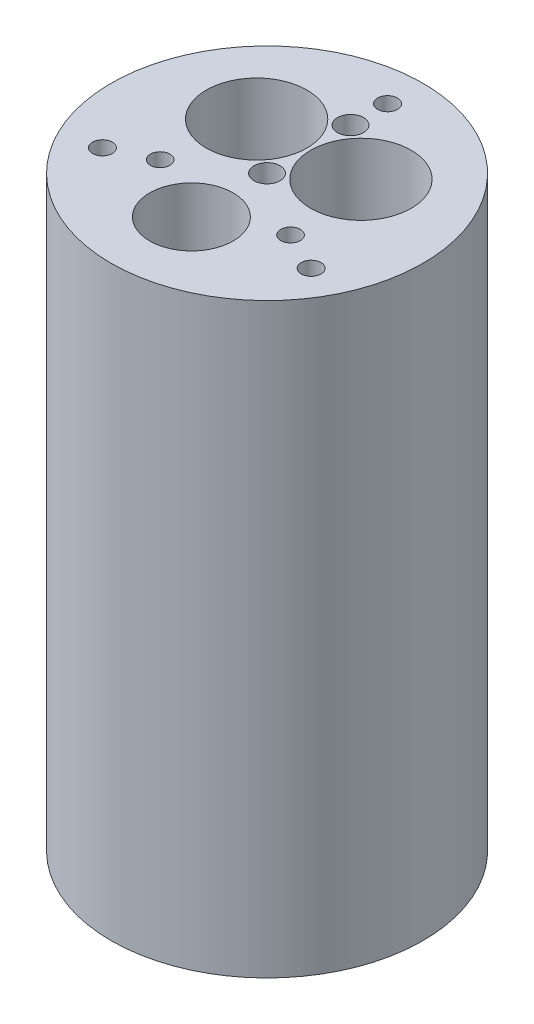
ISO-10303-21;
HEADER;
FILE_DESCRIPTION(('STEP AP214'),'2;1');
FILE_NAME('part.step','',(''),(''),'','','');
FILE_SCHEMA(('AUTOMOTIVE_DESIGN { 1 0 10303 214 1 1 1 1 }'));
ENDSEC;
DATA;
#1=APPLICATION_CONTEXT('core data for automotive mechanical design processes');
#2=APPLICATION_PROTOCOL_DEFINITION('international standard','automotive_design',2000,#1);
#3=PRODUCT_CONTEXT('',#1,'mechanical');
#4=PRODUCT('Part','Part','',(#3));
#5=PRODUCT_RELATED_PRODUCT_CATEGORY('part','',(#4));
#6=PRODUCT_DEFINITION_FORMATION('','',#4);
#7=PRODUCT_DEFINITION_CONTEXT('part definition',#1,'design');
#8=PRODUCT_DEFINITION('design','',#6,#7);
#9=PRODUCT_DEFINITION_SHAPE('','',#8);
#10=(LENGTH_UNIT() NAMED_UNIT(*) SI_UNIT(.MILLI.,.METRE.));
#11=(NAMED_UNIT(*) PLANE_ANGLE_UNIT() SI_UNIT($,.RADIAN.));
#12=(NAMED_UNIT(*) SI_UNIT($,.STERADIAN.) SOLID_ANGLE_UNIT());
#13=UNCERTAINTY_MEASURE_WITH_UNIT(LENGTH_MEASURE(1.E-05),#10,'distance_accuracy_value','');
#14=(GEOMETRIC_REPRESENTATION_CONTEXT(3) GLOBAL_UNCERTAINTY_ASSIGNED_CONTEXT((#13)) GLOBAL_UNIT_ASSIGNED_CONTEXT((#10,
#11,#12)) REPRESENTATION_CONTEXT('',''));
#15=CARTESIAN_POINT('',(0.,0.,0.));
#16=DIRECTION('',(0.,0.,1.));
#17=DIRECTION('',(1.,0.,0.));
#18=AXIS2_PLACEMENT_3D('',#15,#16,#17);
#19=CARTESIAN_POINT('',(0.,142.8496,0.));
#20=DIRECTION('',(0.,-1.,0.));
#21=DIRECTION('',(0.,0.,-1.));
#22=AXIS2_PLACEMENT_3D('',#19,#20,#21);
#23=CYLINDRICAL_SURFACE('',#22,37.973);
#24=CARTESIAN_POINT('',(0.,142.8496,0.));
#25=DIRECTION('',(0.,1.,0.));
#26=DIRECTION('',(0.,0.,1.));
#27=AXIS2_PLACEMENT_3D('',#24,#25,#26);
#28=CIRCLE('',#27,37.973);
#29=CARTESIAN_POINT('',(0.,142.8496,37.973));
#30=VERTEX_POINT('',#29);
#31=EDGE_CURVE('E10',#30,#30,#28,.T.);
#32=ORIENTED_EDGE('',*,*,#31,.F.);
#33=EDGE_LOOP('',(#32));
#34=FACE_BOUND('',#33,.T.);
#35=CARTESIAN_POINT('',(0.,0.,0.));
#36=DIRECTION('',(0.,1.,0.));
#37=DIRECTION('',(0.,0.,1.));
#38=AXIS2_PLACEMENT_3D('',#35,#36,#37);
#39=CIRCLE('',#38,37.973);
#40=CARTESIAN_POINT('',(0.,0.,37.973));
#41=VERTEX_POINT('',#40);
#42=EDGE_CURVE('E38',#41,#41,#39,.T.);
#43=ORIENTED_EDGE('',*,*,#42,.T.);
#44=EDGE_LOOP('',(#43));
#45=FACE_BOUND('',#44,.T.);
#46=ADVANCED_FACE('F35',(#34,#45),#23,.T.);
#47=CARTESIAN_POINT('',(0.,142.8496,0.));
#48=DIRECTION('',(0.,1.,0.));
#49=DIRECTION('',(0.,0.,1.));
#50=AXIS2_PLACEMENT_3D('',#47,#48,#49);
#51=PLANE('',#50);
#52=CARTESIAN_POINT('',(15.875,142.8496,10.16));
#53=DIRECTION('',(0.,1.,0.));
#54=DIRECTION('',(0.,0.,1.));
#55=AXIS2_PLACEMENT_3D('',#52,#53,#54);
#56=CIRCLE('',#55,2.38125000000001);
#57=CARTESIAN_POINT('',(15.875,142.8496,12.54125));
#58=VERTEX_POINT('',#57);
#59=EDGE_CURVE('E92',#58,#58,#56,.T.);
#60=ORIENTED_EDGE('',*,*,#59,.F.);
#61=EDGE_LOOP('',(#60));
#62=FACE_BOUND('',#61,.T.);
#63=CARTESIAN_POINT('',(-15.875,142.8496,10.16));
#64=DIRECTION('',(0.,1.,0.));
#65=DIRECTION('',(0.,0.,1.));
#66=AXIS2_PLACEMENT_3D('',#63,#64,#65);
#67=CIRCLE('',#66,2.38125);
#68=CARTESIAN_POINT('',(-15.875,142.8496,12.54125));
#69=VERTEX_POINT('',#68);
#70=EDGE_CURVE('E97',#69,#69,#67,.T.);
#71=ORIENTED_EDGE('',*,*,#70,.F.);
#72=EDGE_LOOP('',(#71));
#73=FACE_BOUND('',#72,.T.);
#74=CARTESIAN_POINT('',(0.,142.8496,18.415));
#75=DIRECTION('',(0.,1.,0.));
#76=DIRECTION('',(0.,0.,1.));
#77=AXIS2_PLACEMENT_3D('',#74,#75,#76);
#78=CIRCLE('',#77,10.16);
#79=CARTESIAN_POINT('',(0.,142.8496,28.575));
#80=VERTEX_POINT('',#79);
#81=EDGE_CURVE('E89',#80,#80,#78,.T.);
#82=ORIENTED_EDGE('',*,*,#81,.F.);
#83=EDGE_LOOP('',(#82));
#84=FACE_BOUND('',#83,.T.);
#85=CARTESIAN_POINT('',(0.,142.8496,-20.32));
#86=DIRECTION('',(0.,1.,0.));
#87=DIRECTION('',(0.,0.,1.));
#88=AXIS2_PLACEMENT_3D('',#85,#86,#87);
#89=CIRCLE('',#88,3.175);
#90=CARTESIAN_POINT('',(0.,142.8496,-17.145));
#91=VERTEX_POINT('',#90);
#92=EDGE_CURVE('E84',#91,#91,#89,.T.);
#93=ORIENTED_EDGE('',*,*,#92,.F.);
#94=EDGE_LOOP('',(#93));
#95=FACE_BOUND('',#94,.T.);
#96=CARTESIAN_POINT('',(0.,142.8496,0.));
#97=DIRECTION('',(0.,1.,0.));
#98=DIRECTION('',(0.,0.,1.));
#99=AXIS2_PLACEMENT_3D('',#96,#97,#98);
#100=CIRCLE('',#99,3.175);
#101=CARTESIAN_POINT('',(0.,142.8496,3.175));
#102=VERTEX_POINT('',#101);
#103=EDGE_CURVE('E77',#102,#102,#100,.T.);
#104=ORIENTED_EDGE('',*,*,#103,.F.);
#105=EDGE_LOOP('',(#104));
#106=FACE_BOUND('',#105,.T.);
#107=CARTESIAN_POINT('',(-12.7,142.8496,-10.16));
#108=DIRECTION('',(0.,1.,0.));
#109=DIRECTION('',(0.,0.,1.));
#110=AXIS2_PLACEMENT_3D('',#107,#108,#109);
#111=CIRCLE('',#110,12.2555);
#112=CARTESIAN_POINT('',(-12.7,142.8496,2.0955));
#113=VERTEX_POINT('',#112);
#114=EDGE_CURVE('E72',#113,#113,#111,.T.);
#115=ORIENTED_EDGE('',*,*,#114,.F.);
#116=EDGE_LOOP('',(#115));
#117=FACE_BOUND('',#116,.T.);
#118=CARTESIAN_POINT('',(12.7,142.8496,-10.16));
#119=DIRECTION('',(0.,1.,0.));
#120=DIRECTION('',(0.,0.,1.));
#121=AXIS2_PLACEMENT_3D('',#118,#119,#120);
#122=CIRCLE('',#121,12.2555);
#123=CARTESIAN_POINT('',(12.7,142.8496,2.0955));
#124=VERTEX_POINT('',#123);
#125=EDGE_CURVE('E65',#124,#124,#122,.T.);
#126=ORIENTED_EDGE('',*,*,#125,.F.);
#127=EDGE_LOOP('',(#126));
#128=FACE_BOUND('',#127,.T.);
#129=CARTESIAN_POINT('',(0.,142.8496,-29.337));
#130=DIRECTION('',(0.,1.,0.));
#131=DIRECTION('',(0.,0.,1.));
#132=AXIS2_PLACEMENT_3D('',#129,#130,#131);
#133=CIRCLE('',#132,2.413);
#134=CARTESIAN_POINT('',(0.,142.8496,-26.924));
#135=VERTEX_POINT('',#134);
#136=EDGE_CURVE('E60',#135,#135,#133,.T.);
#137=ORIENTED_EDGE('',*,*,#136,.F.);
#138=EDGE_LOOP('',(#137));
#139=FACE_BOUND('',#138,.T.);
#140=CARTESIAN_POINT('',(25.4065872708259,142.8496,14.6684999999989));
#141=DIRECTION('',(0.,1.,0.));
#142=DIRECTION('',(0.,0.,1.));
#143=AXIS2_PLACEMENT_3D('',#140,#141,#142);
#144=CIRCLE('',#143,2.413);
#145=CARTESIAN_POINT('',(25.4065872708259,142.8496,17.0814999999989));
#146=VERTEX_POINT('',#145);
#147=EDGE_CURVE('E54',#146,#146,#144,.T.);
#148=ORIENTED_EDGE('',*,*,#147,.F.);
#149=EDGE_LOOP('',(#148));
#150=FACE_BOUND('',#149,.T.);
#151=CARTESIAN_POINT('',(-25.4065872708222,142.8496,14.6685000000011));
#152=DIRECTION('',(0.,1.,0.));
#153=DIRECTION('',(0.,0.,1.));
#154=AXIS2_PLACEMENT_3D('',#151,#152,#153);
#155=CIRCLE('',#154,2.413);
#156=CARTESIAN_POINT('',(-25.4065872708222,142.8496,17.0815000000011));
#157=VERTEX_POINT('',#156);
#158=EDGE_CURVE('E47',#157,#157,#155,.T.);
#159=ORIENTED_EDGE('',*,*,#158,.F.);
#160=EDGE_LOOP('',(#159));
#161=FACE_BOUND('',#160,.T.);
#162=ORIENTED_EDGE('',*,*,#31,.T.);
#163=EDGE_LOOP('',(#162));
#164=FACE_BOUND('',#163,.T.);
#165=ADVANCED_FACE('F122',(#62,#73,#84,#95,#106,#117,#128,#139,#150,#161,#164),#51,.T.);
#166=CARTESIAN_POINT('',(0.,0.,0.));
#167=DIRECTION('',(0.,1.,0.));
#168=DIRECTION('',(0.,0.,1.));
#169=AXIS2_PLACEMENT_3D('',#166,#167,#168);
#170=PLANE('',#169);
#171=CARTESIAN_POINT('',(15.875,0.,10.16));
#172=DIRECTION('',(0.,1.,0.));
#173=DIRECTION('',(0.,0.,1.));
#174=AXIS2_PLACEMENT_3D('',#171,#172,#173);
#175=CIRCLE('',#174,2.38125000000001);
#176=CARTESIAN_POINT('',(15.875,0.,12.54125));
#177=VERTEX_POINT('',#176);
#178=EDGE_CURVE('E100',#177,#177,#175,.T.);
#179=ORIENTED_EDGE('',*,*,#178,.T.);
#180=EDGE_LOOP('',(#179));
#181=FACE_BOUND('',#180,.T.);
#182=CARTESIAN_POINT('',(-15.875,0.,10.16));
#183=DIRECTION('',(0.,1.,0.));
#184=DIRECTION('',(0.,0.,1.));
#185=AXIS2_PLACEMENT_3D('',#182,#183,#184);
#186=CIRCLE('',#185,2.38125);
#187=CARTESIAN_POINT('',(-15.875,0.,12.54125));
#188=VERTEX_POINT('',#187);
#189=EDGE_CURVE('E101',#188,#188,#186,.T.);
#190=ORIENTED_EDGE('',*,*,#189,.T.);
#191=EDGE_LOOP('',(#190));
#192=FACE_BOUND('',#191,.T.);
#193=CARTESIAN_POINT('',(-12.7,0.,-10.16));
#194=DIRECTION('',(0.,1.,0.));
#195=DIRECTION('',(0.,0.,1.));
#196=AXIS2_PLACEMENT_3D('',#193,#194,#195);
#197=CIRCLE('',#196,12.2555);
#198=CARTESIAN_POINT('',(-12.7,0.,2.0955));
#199=VERTEX_POINT('',#198);
#200=EDGE_CURVE('E51',#199,#199,#197,.T.);
#201=ORIENTED_EDGE('',*,*,#200,.T.);
#202=EDGE_LOOP('',(#201));
#203=FACE_BOUND('',#202,.T.);
#204=CARTESIAN_POINT('',(12.7,0.,-10.16));
#205=DIRECTION('',(0.,1.,0.));
#206=DIRECTION('',(0.,0.,1.));
#207=AXIS2_PLACEMENT_3D('',#204,#205,#206);
#208=CIRCLE('',#207,12.2555);
#209=CARTESIAN_POINT('',(12.7,0.,2.0955));
#210=VERTEX_POINT('',#209);
#211=EDGE_CURVE('E68',#210,#210,#208,.T.);
#212=ORIENTED_EDGE('',*,*,#211,.T.);
#213=EDGE_LOOP('',(#212));
#214=FACE_BOUND('',#213,.T.);
#215=CARTESIAN_POINT('',(0.,0.,-29.337));
#216=DIRECTION('',(0.,1.,0.));
#217=DIRECTION('',(0.,0.,1.));
#218=AXIS2_PLACEMENT_3D('',#215,#216,#217);
#219=CIRCLE('',#218,2.413);
#220=CARTESIAN_POINT('',(0.,0.,-26.924));
#221=VERTEX_POINT('',#220);
#222=EDGE_CURVE('E45',#221,#221,#219,.T.);
#223=ORIENTED_EDGE('',*,*,#222,.T.);
#224=EDGE_LOOP('',(#223));
#225=FACE_BOUND('',#224,.T.);
#226=CARTESIAN_POINT('',(25.4065872708259,0.,14.6684999999989));
#227=DIRECTION('',(0.,1.,0.));
#228=DIRECTION('',(0.,0.,1.));
#229=AXIS2_PLACEMENT_3D('',#226,#227,#228);
#230=CIRCLE('',#229,2.413);
#231=CARTESIAN_POINT('',(25.4065872708259,0.,17.0814999999989));
#232=VERTEX_POINT('',#231);
#233=EDGE_CURVE('E57',#232,#232,#230,.T.);
#234=ORIENTED_EDGE('',*,*,#233,.T.);
#235=EDGE_LOOP('',(#234));
#236=FACE_BOUND('',#235,.T.);
#237=CARTESIAN_POINT('',(-25.4065872708222,0.,14.6685000000011));
#238=DIRECTION('',(0.,1.,0.));
#239=DIRECTION('',(0.,0.,1.));
#240=AXIS2_PLACEMENT_3D('',#237,#238,#239);
#241=CIRCLE('',#240,2.413);
#242=CARTESIAN_POINT('',(-25.4065872708222,0.,17.0815000000011));
#243=VERTEX_POINT('',#242);
#244=EDGE_CURVE('E50',#243,#243,#241,.T.);
#245=ORIENTED_EDGE('',*,*,#244,.T.);
#246=EDGE_LOOP('',(#245));
#247=FACE_BOUND('',#246,.T.);
#248=ORIENTED_EDGE('',*,*,#42,.F.);
#249=EDGE_LOOP('',(#248));
#250=FACE_BOUND('',#249,.T.);
#251=ADVANCED_FACE('F107',(#181,#192,#203,#214,#225,#236,#247,#250),#170,.F.);
#252=CARTESIAN_POINT('',(-25.4065872708222,0.,14.6685000000011));
#253=DIRECTION('',(0.,1.,0.));
#254=DIRECTION('',(0.,0.,1.));
#255=AXIS2_PLACEMENT_3D('',#252,#253,#254);
#256=CYLINDRICAL_SURFACE('',#255,2.413);
#257=ORIENTED_EDGE('',*,*,#244,.F.);
#258=EDGE_LOOP('',(#257));
#259=FACE_BOUND('',#258,.T.);
#260=ORIENTED_EDGE('',*,*,#158,.T.);
#261=EDGE_LOOP('',(#260));
#262=FACE_BOUND('',#261,.T.);
#263=ADVANCED_FACE('F133',(#259,#262),#256,.F.);
#264=CARTESIAN_POINT('',(25.4065872708259,0.,14.6684999999989));
#265=DIRECTION('',(0.,1.,0.));
#266=DIRECTION('',(0.,0.,1.));
#267=AXIS2_PLACEMENT_3D('',#264,#265,#266);
#268=CYLINDRICAL_SURFACE('',#267,2.413);
#269=ORIENTED_EDGE('',*,*,#233,.F.);
#270=EDGE_LOOP('',(#269));
#271=FACE_BOUND('',#270,.T.);
#272=ORIENTED_EDGE('',*,*,#147,.T.);
#273=EDGE_LOOP('',(#272));
#274=FACE_BOUND('',#273,.T.);
#275=ADVANCED_FACE('F137',(#271,#274),#268,.F.);
#276=CARTESIAN_POINT('',(0.,0.,-29.337));
#277=DIRECTION('',(0.,1.,0.));
#278=DIRECTION('',(0.,0.,1.));
#279=AXIS2_PLACEMENT_3D('',#276,#277,#278);
#280=CYLINDRICAL_SURFACE('',#279,2.413);
#281=ORIENTED_EDGE('',*,*,#222,.F.);
#282=EDGE_LOOP('',(#281));
#283=FACE_BOUND('',#282,.T.);
#284=ORIENTED_EDGE('',*,*,#136,.T.);
#285=EDGE_LOOP('',(#284));
#286=FACE_BOUND('',#285,.T.);
#287=ADVANCED_FACE('F143',(#283,#286),#280,.F.);
#288=CARTESIAN_POINT('',(12.7,0.,-10.16));
#289=DIRECTION('',(0.,1.,0.));
#290=DIRECTION('',(0.,0.,1.));
#291=AXIS2_PLACEMENT_3D('',#288,#289,#290);
#292=CYLINDRICAL_SURFACE('',#291,12.2555);
#293=ORIENTED_EDGE('',*,*,#211,.F.);
#294=EDGE_LOOP('',(#293));
#295=FACE_BOUND('',#294,.T.);
#296=ORIENTED_EDGE('',*,*,#125,.T.);
#297=EDGE_LOOP('',(#296));
#298=FACE_BOUND('',#297,.T.);
#299=ADVANCED_FACE('F147',(#295,#298),#292,.F.);
#300=CARTESIAN_POINT('',(-12.7,0.,-10.16));
#301=DIRECTION('',(0.,1.,0.));
#302=DIRECTION('',(0.,0.,1.));
#303=AXIS2_PLACEMENT_3D('',#300,#301,#302);
#304=CYLINDRICAL_SURFACE('',#303,12.2555);
#305=ORIENTED_EDGE('',*,*,#200,.F.);
#306=EDGE_LOOP('',(#305));
#307=FACE_BOUND('',#306,.T.);
#308=ORIENTED_EDGE('',*,*,#114,.T.);
#309=EDGE_LOOP('',(#308));
#310=FACE_BOUND('',#309,.T.);
#311=ADVANCED_FACE('F151',(#307,#310),#304,.F.);
#312=CARTESIAN_POINT('',(0.,136.4996,0.));
#313=DIRECTION('',(0.,1.,0.));
#314=DIRECTION('',(0.,0.,1.));
#315=AXIS2_PLACEMENT_3D('',#312,#313,#314);
#316=CYLINDRICAL_SURFACE('',#315,3.175);
#317=CARTESIAN_POINT('',(0.,136.4996,0.));
#318=DIRECTION('',(0.,1.,0.));
#319=DIRECTION('',(0.,0.,1.));
#320=AXIS2_PLACEMENT_3D('',#317,#318,#319);
#321=CIRCLE('',#320,3.175);
#322=CARTESIAN_POINT('',(0.,136.4996,3.175));
#323=VERTEX_POINT('',#322);
#324=EDGE_CURVE('E80',#323,#323,#321,.T.);
#325=ORIENTED_EDGE('',*,*,#324,.F.);
#326=EDGE_LOOP('',(#325));
#327=FACE_BOUND('',#326,.T.);
#328=ORIENTED_EDGE('',*,*,#103,.T.);
#329=EDGE_LOOP('',(#328));
#330=FACE_BOUND('',#329,.T.);
#331=ADVANCED_FACE('F155',(#327,#330),#316,.F.);
#332=CARTESIAN_POINT('',(0.,136.4996,0.));
#333=DIRECTION('',(0.,1.,0.));
#334=DIRECTION('',(0.,0.,1.));
#335=AXIS2_PLACEMENT_3D('',#332,#333,#334);
#336=PLANE('',#335);
#337=ORIENTED_EDGE('',*,*,#324,.T.);
#338=EDGE_LOOP('',(#337));
#339=FACE_BOUND('',#338,.T.);
#340=ADVANCED_FACE('F159',(#339),#336,.T.);
#341=CARTESIAN_POINT('',(0.,136.4996,-20.32));
#342=DIRECTION('',(0.,1.,0.));
#343=DIRECTION('',(0.,0.,1.));
#344=AXIS2_PLACEMENT_3D('',#341,#342,#343);
#345=CYLINDRICAL_SURFACE('',#344,3.175);
#346=CARTESIAN_POINT('',(0.,136.4996,-20.32));
#347=DIRECTION('',(0.,1.,0.));
#348=DIRECTION('',(0.,0.,1.));
#349=AXIS2_PLACEMENT_3D('',#346,#347,#348);
#350=CIRCLE('',#349,3.175);
#351=CARTESIAN_POINT('',(0.,136.4996,-17.145));
#352=VERTEX_POINT('',#351);
#353=EDGE_CURVE('E69',#352,#352,#350,.T.);
#354=ORIENTED_EDGE('',*,*,#353,.F.);
#355=EDGE_LOOP('',(#354));
#356=FACE_BOUND('',#355,.T.);
#357=ORIENTED_EDGE('',*,*,#92,.T.);
#358=EDGE_LOOP('',(#357));
#359=FACE_BOUND('',#358,.T.);
#360=ADVANCED_FACE('F163',(#356,#359),#345,.F.);
#361=CARTESIAN_POINT('',(0.,136.4996,-20.32));
#362=DIRECTION('',(0.,1.,0.));
#363=DIRECTION('',(0.,0.,1.));
#364=AXIS2_PLACEMENT_3D('',#361,#362,#363);
#365=PLANE('',#364);
#366=ORIENTED_EDGE('',*,*,#353,.T.);
#367=EDGE_LOOP('',(#366));
#368=FACE_BOUND('',#367,.T.);
#369=ADVANCED_FACE('F167',(#368),#365,.T.);
#370=CARTESIAN_POINT('',(0.,125.0696,18.415));
#371=DIRECTION('',(0.,1.,0.));
#372=DIRECTION('',(0.,0.,1.));
#373=AXIS2_PLACEMENT_3D('',#370,#371,#372);
#374=CYLINDRICAL_SURFACE('',#373,10.16);
#375=CARTESIAN_POINT('',(0.,125.0696,18.415));
#376=DIRECTION('',(0.,1.,0.));
#377=DIRECTION('',(0.,0.,1.));
#378=AXIS2_PLACEMENT_3D('',#375,#376,#377);
#379=CIRCLE('',#378,10.16);
#380=CARTESIAN_POINT('',(0.,125.0696,28.575));
#381=VERTEX_POINT('',#380);
#382=EDGE_CURVE('E81',#381,#381,#379,.T.);
#383=ORIENTED_EDGE('',*,*,#382,.F.);
#384=EDGE_LOOP('',(#383));
#385=FACE_BOUND('',#384,.T.);
#386=ORIENTED_EDGE('',*,*,#81,.T.);
#387=EDGE_LOOP('',(#386));
#388=FACE_BOUND('',#387,.T.);
#389=ADVANCED_FACE('F171',(#385,#388),#374,.F.);
#390=CARTESIAN_POINT('',(0.,125.0696,18.415));
#391=DIRECTION('',(0.,1.,0.));
#392=DIRECTION('',(0.,0.,1.));
#393=AXIS2_PLACEMENT_3D('',#390,#391,#392);
#394=PLANE('',#393);
#395=ORIENTED_EDGE('',*,*,#382,.T.);
#396=EDGE_LOOP('',(#395));
#397=FACE_BOUND('',#396,.T.);
#398=ADVANCED_FACE('F118',(#397),#394,.T.);
#399=CARTESIAN_POINT('',(-15.875,0.,10.16));
#400=DIRECTION('',(0.,1.,0.));
#401=DIRECTION('',(0.,0.,1.));
#402=AXIS2_PLACEMENT_3D('',#399,#400,#401);
#403=CYLINDRICAL_SURFACE('',#402,2.38125);
#404=ORIENTED_EDGE('',*,*,#70,.T.);
#405=EDGE_LOOP('',(#404));
#406=FACE_BOUND('',#405,.T.);
#407=ORIENTED_EDGE('',*,*,#189,.F.);
#408=EDGE_LOOP('',(#407));
#409=FACE_BOUND('',#408,.T.);
#410=ADVANCED_FACE('F112',(#406,#409),#403,.F.);
#411=CARTESIAN_POINT('',(15.875,0.,10.16));
#412=DIRECTION('',(0.,1.,0.));
#413=DIRECTION('',(0.,0.,1.));
#414=AXIS2_PLACEMENT_3D('',#411,#412,#413);
#415=CYLINDRICAL_SURFACE('',#414,2.38125000000001);
#416=ORIENTED_EDGE('',*,*,#59,.T.);
#417=EDGE_LOOP('',(#416));
#418=FACE_BOUND('',#417,.T.);
#419=ORIENTED_EDGE('',*,*,#178,.F.);
#420=EDGE_LOOP('',(#419));
#421=FACE_BOUND('',#420,.T.);
#422=ADVANCED_FACE('F110',(#418,#421),#415,.F.);
#423=CLOSED_SHELL('',(#46,#165,#251,#263,#275,#287,#299,#311,#331,#340,#360,#369,#389,#398,#410,#422));
#424=MANIFOLD_SOLID_BREP('B2',#423);
#425=ADVANCED_BREP_SHAPE_REPRESENTATION('',(#18,#424),#14);
#426=SHAPE_DEFINITION_REPRESENTATION(#9,#425);
ENDSEC;
END-ISO-10303-21;
